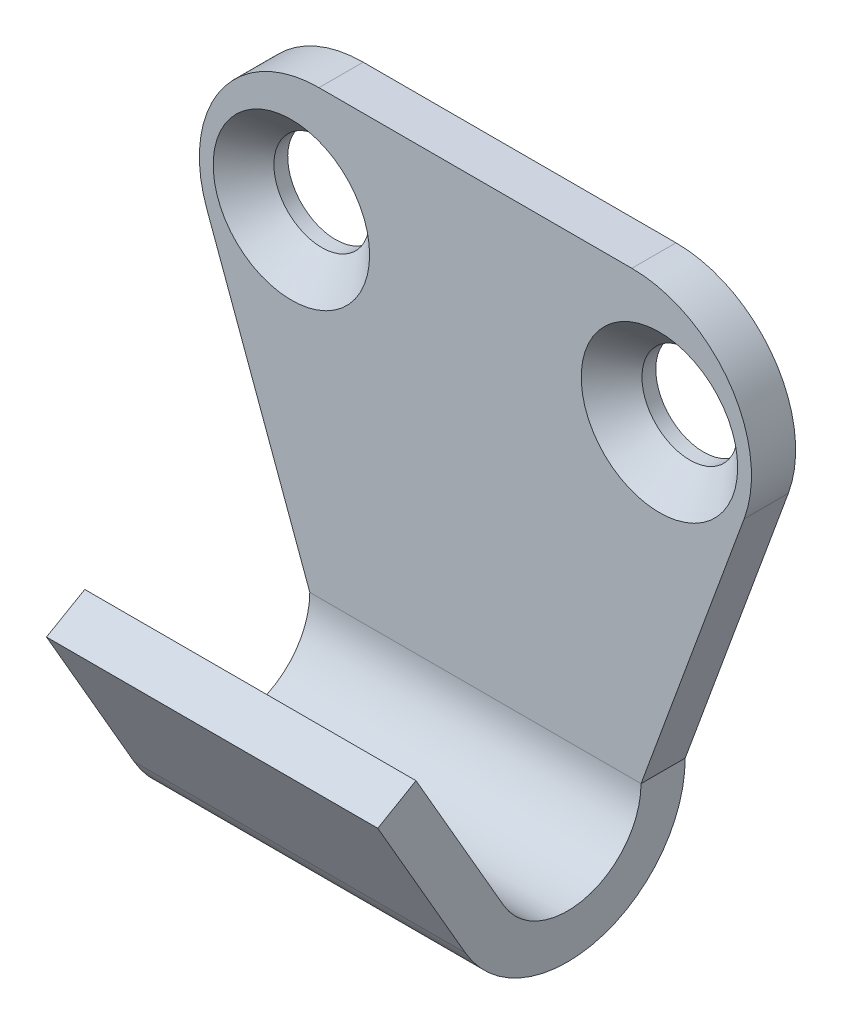
ISO-10303-21;
HEADER;
FILE_DESCRIPTION(('STEP AP214'),'2;1');
FILE_NAME('part.step','',(''),(''),'','','');
FILE_SCHEMA(('AUTOMOTIVE_DESIGN { 1 0 10303 214 1 1 1 1 }'));
ENDSEC;
DATA;
#1=APPLICATION_CONTEXT('core data for automotive mechanical design processes');
#2=APPLICATION_PROTOCOL_DEFINITION('international standard','automotive_design',2000,#1);
#3=PRODUCT_CONTEXT('',#1,'mechanical');
#4=PRODUCT('Part','Part','',(#3));
#5=PRODUCT_RELATED_PRODUCT_CATEGORY('part','',(#4));
#6=PRODUCT_DEFINITION_FORMATION('','',#4);
#7=PRODUCT_DEFINITION_CONTEXT('part definition',#1,'design');
#8=PRODUCT_DEFINITION('design','',#6,#7);
#9=PRODUCT_DEFINITION_SHAPE('','',#8);
#10=(LENGTH_UNIT() NAMED_UNIT(*) SI_UNIT(.MILLI.,.METRE.));
#11=(NAMED_UNIT(*) PLANE_ANGLE_UNIT() SI_UNIT($,.RADIAN.));
#12=(NAMED_UNIT(*) SI_UNIT($,.STERADIAN.) SOLID_ANGLE_UNIT());
#13=UNCERTAINTY_MEASURE_WITH_UNIT(LENGTH_MEASURE(1.E-05),#10,'distance_accuracy_value','');
#14=(GEOMETRIC_REPRESENTATION_CONTEXT(3) GLOBAL_UNCERTAINTY_ASSIGNED_CONTEXT((#13)) GLOBAL_UNIT_ASSIGNED_CONTEXT((#10,
#11,#12)) REPRESENTATION_CONTEXT('',''));
#15=CARTESIAN_POINT('',(0.,0.,0.));
#16=DIRECTION('',(0.,0.,1.));
#17=DIRECTION('',(1.,0.,0.));
#18=AXIS2_PLACEMENT_3D('',#15,#16,#17);
#19=CARTESIAN_POINT('',(-0.0998757230143876,36.5453689760703,3.0802936243158));
#20=DIRECTION('',(0.,0.5,-0.866025403784439));
#21=DIRECTION('',(0.,0.866025403784439,0.5));
#22=AXIS2_PLACEMENT_3D('',#19,#20,#21);
#23=PLANE('',#22);
#24=DIRECTION('',(1.,0.,0.));
#25=VECTOR('',#24,1.);
#26=CARTESIAN_POINT('',(8.90012427698563,56.5467803394834,14.6281138591548));
#27=LINE('',#26,#25);
#28=CARTESIAN_POINT('',(8.90012427698561,56.5467803394834,14.6281138591548));
#29=VERTEX_POINT('',#28);
#30=CARTESIAN_POINT('',(-9.09987572301438,56.5467803394834,14.6281138591548));
#31=VERTEX_POINT('',#30);
#32=EDGE_CURVE('E93',#29,#31,#27,.F.);
#33=ORIENTED_EDGE('',*,*,#32,.F.);
#34=DIRECTION('',(0.,0.866025403784438,0.500000000000002));
#35=VECTOR('',#34,1.);
#36=CARTESIAN_POINT('',(8.90012427698561,48.2952690849657,9.86410161513776));
#37=LINE('',#36,#35);
#38=CARTESIAN_POINT('',(8.90012427698561,48.2952690849657,9.86410161513776));
#39=VERTEX_POINT('',#38);
#40=EDGE_CURVE('E122',#39,#29,#37,.T.);
#41=ORIENTED_EDGE('',*,*,#40,.F.);
#42=DIRECTION('',(1.,0.,0.));
#43=VECTOR('',#42,1.);
#44=CARTESIAN_POINT('',(-0.0998757230143811,48.2952690849657,9.86410161513775));
#45=LINE('',#44,#43);
#46=CARTESIAN_POINT('',(-9.09987572301438,48.2952690849657,9.86410161513775));
#47=VERTEX_POINT('',#46);
#48=EDGE_CURVE('E84',#47,#39,#45,.T.);
#49=ORIENTED_EDGE('',*,*,#48,.F.);
#50=DIRECTION('',(0.,-0.866025403784438,-0.500000000000002));
#51=VECTOR('',#50,1.);
#52=CARTESIAN_POINT('',(-9.09987572301437,56.5467803394834,14.6281138591548));
#53=LINE('',#52,#51);
#54=EDGE_CURVE('E135',#31,#47,#53,.T.);
#55=ORIENTED_EDGE('',*,*,#54,.F.);
#56=EDGE_LOOP('',(#33,#41,#49,#55));
#57=FACE_BOUND('',#56,.T.);
#58=ADVANCED_FACE('F16',(#57),#23,.T.);
#59=CARTESIAN_POINT('',(8.90012427698563,55.3467803394834,16.7065748282374));
#60=DIRECTION('',(0.,0.866025403784439,0.5));
#61=DIRECTION('',(0.,-0.5,0.866025403784439));
#62=AXIS2_PLACEMENT_3D('',#59,#60,#61);
#63=PLANE('',#62);
#64=DIRECTION('',(1.,0.,0.));
#65=VECTOR('',#64,1.);
#66=CARTESIAN_POINT('',(-0.0998757230143878,55.3467803394834,16.7065748282374));
#67=LINE('',#66,#65);
#68=CARTESIAN_POINT('',(8.90012427698561,55.3467803394834,16.7065748282374));
#69=VERTEX_POINT('',#68);
#70=CARTESIAN_POINT('',(-9.09987572301437,55.3467803394834,16.7065748282374));
#71=VERTEX_POINT('',#70);
#72=EDGE_CURVE('E98',#69,#71,#67,.F.);
#73=ORIENTED_EDGE('',*,*,#72,.F.);
#74=DIRECTION('',(0.,-0.500000000000007,0.866025403784435));
#75=VECTOR('',#74,1.);
#76=CARTESIAN_POINT('',(8.90012427698561,56.5467803394834,14.6281138591548));
#77=LINE('',#76,#75);
#78=EDGE_CURVE('E102',#29,#69,#77,.T.);
#79=ORIENTED_EDGE('',*,*,#78,.F.);
#80=ORIENTED_EDGE('',*,*,#32,.T.);
#81=DIRECTION('',(0.,0.500000000000007,-0.866025403784434));
#82=VECTOR('',#81,1.);
#83=CARTESIAN_POINT('',(-9.09987572301437,55.3467803394834,16.7065748282374));
#84=LINE('',#83,#82);
#85=EDGE_CURVE('E105',#71,#31,#84,.T.);
#86=ORIENTED_EDGE('',*,*,#85,.F.);
#87=EDGE_LOOP('',(#73,#79,#80,#86));
#88=FACE_BOUND('',#87,.T.);
#89=ADVANCED_FACE('F100',(#88),#63,.T.);
#90=CARTESIAN_POINT('',(8.90012427698561,50.2952690849657,6.4));
#91=DIRECTION('',(-1.,0.,0.));
#92=DIRECTION('',(0.,0.,1.));
#93=AXIS2_PLACEMENT_3D('',#90,#91,#92);
#94=CYLINDRICAL_SURFACE('',#93,4.);
#95=DIRECTION('',(1.,0.,0.));
#96=VECTOR('',#95,1.);
#97=CARTESIAN_POINT('',(-0.0998757230143808,50.2952690849657,2.4));
#98=LINE('',#97,#96);
#99=CARTESIAN_POINT('',(-9.09987572301439,50.2952690849657,2.4));
#100=VERTEX_POINT('',#99);
#101=CARTESIAN_POINT('',(8.9001242769856,50.2952690849657,2.4));
#102=VERTEX_POINT('',#101);
#103=EDGE_CURVE('E124',#100,#102,#98,.T.);
#104=ORIENTED_EDGE('',*,*,#103,.F.);
#105=CARTESIAN_POINT('',(-9.09987572301439,50.2952690849657,6.4));
#106=DIRECTION('',(-1.,0.,0.));
#107=DIRECTION('',(0.,0.,1.));
#108=AXIS2_PLACEMENT_3D('',#105,#106,#107);
#109=CIRCLE('',#108,4.);
#110=EDGE_CURVE('E20',#47,#100,#109,.F.);
#111=ORIENTED_EDGE('',*,*,#110,.F.);
#112=ORIENTED_EDGE('',*,*,#48,.T.);
#113=CARTESIAN_POINT('',(8.90012427698561,50.2952690849657,6.4));
#114=DIRECTION('',(-1.,0.,0.));
#115=DIRECTION('',(0.,0.,1.));
#116=AXIS2_PLACEMENT_3D('',#113,#114,#115);
#117=CIRCLE('',#116,4.);
#118=EDGE_CURVE('E117',#102,#39,#117,.T.);
#119=ORIENTED_EDGE('',*,*,#118,.F.);
#120=EDGE_LOOP('',(#104,#111,#112,#119));
#121=FACE_BOUND('',#120,.T.);
#122=ADVANCED_FACE('F175',(#121),#94,.F.);
#123=CARTESIAN_POINT('',(-0.0998757230143878,35.3453689760703,5.15875459339845));
#124=DIRECTION('',(0.,-0.5,0.866025403784439));
#125=DIRECTION('',(0.,-0.866025403784439,-0.5));
#126=AXIS2_PLACEMENT_3D('',#123,#124,#125);
#127=PLANE('',#126);
#128=ORIENTED_EDGE('',*,*,#72,.T.);
#129=DIRECTION('',(0.,0.86602540378444,0.499999999999998));
#130=VECTOR('',#129,1.);
#131=CARTESIAN_POINT('',(-9.09987572301437,47.0952690849657,11.9425625842204));
#132=LINE('',#131,#130);
#133=CARTESIAN_POINT('',(-9.09987572301438,47.0952690849657,11.9425625842204));
#134=VERTEX_POINT('',#133);
#135=EDGE_CURVE('E108',#134,#71,#132,.T.);
#136=ORIENTED_EDGE('',*,*,#135,.F.);
#137=DIRECTION('',(-1.,0.,0.));
#138=VECTOR('',#137,1.);
#139=CARTESIAN_POINT('',(-9.09987572301437,47.0952690849657,11.9425625842204));
#140=LINE('',#139,#138);
#141=CARTESIAN_POINT('',(8.90012427698561,47.0952690849657,11.9425625842204));
#142=VERTEX_POINT('',#141);
#143=EDGE_CURVE('E114',#142,#134,#140,.T.);
#144=ORIENTED_EDGE('',*,*,#143,.F.);
#145=DIRECTION('',(0.,-0.86602540378444,-0.499999999999998));
#146=VECTOR('',#145,1.);
#147=CARTESIAN_POINT('',(8.90012427698561,55.3467803394834,16.7065748282374));
#148=LINE('',#147,#146);
#149=EDGE_CURVE('E111',#69,#142,#148,.T.);
#150=ORIENTED_EDGE('',*,*,#149,.F.);
#151=EDGE_LOOP('',(#128,#136,#144,#150));
#152=FACE_BOUND('',#151,.T.);
#153=ADVANCED_FACE('F112',(#152),#127,.T.);
#154=CARTESIAN_POINT('',(-9.09987572301437,55.3467803394834,16.7065748282374));
#155=DIRECTION('',(-1.,0.,0.));
#156=DIRECTION('',(0.,-1.,0.));
#157=AXIS2_PLACEMENT_3D('',#154,#155,#156);
#158=PLANE('',#157);
#159=DIRECTION('',(0.,0.,1.));
#160=VECTOR('',#159,1.);
#161=CARTESIAN_POINT('',(-9.09987572301439,50.2952690849657,0.));
#162=LINE('',#161,#160);
#163=CARTESIAN_POINT('',(-9.09987572301439,50.2952690849657,0.));
#164=VERTEX_POINT('',#163);
#165=EDGE_CURVE('E157',#164,#100,#162,.T.);
#166=ORIENTED_EDGE('',*,*,#165,.F.);
#167=CARTESIAN_POINT('',(-9.09987572301439,50.2952690849657,6.4));
#168=DIRECTION('',(-1.,0.,0.));
#169=DIRECTION('',(0.,-1.,0.));
#170=AXIS2_PLACEMENT_3D('',#167,#168,#169);
#171=CIRCLE('',#170,6.4);
#172=EDGE_CURVE('E161',#134,#164,#171,.F.);
#173=ORIENTED_EDGE('',*,*,#172,.F.);
#174=ORIENTED_EDGE('',*,*,#135,.T.);
#175=ORIENTED_EDGE('',*,*,#85,.T.);
#176=ORIENTED_EDGE('',*,*,#54,.T.);
#177=ORIENTED_EDGE('',*,*,#110,.T.);
#178=EDGE_LOOP('',(#166,#173,#174,#175,#176,#177));
#179=FACE_BOUND('',#178,.T.);
#180=ADVANCED_FACE('F242',(#179),#158,.T.);
#181=CARTESIAN_POINT('',(-0.0998757230143808,53.3909095546436,2.4));
#182=DIRECTION('',(0.,0.,1.));
#183=DIRECTION('',(1.,0.,0.));
#184=AXIS2_PLACEMENT_3D('',#181,#182,#183);
#185=PLANE('',#184);
#186=CARTESIAN_POINT('',(-10.0998757230144,67.7952690849657,2.40000000000001));
#187=DIRECTION('',(0.,0.,1.));
#188=DIRECTION('',(1.,0.,0.));
#189=AXIS2_PLACEMENT_3D('',#186,#187,#188);
#190=CIRCLE('',#189,4.25000000000001);
#191=CARTESIAN_POINT('',(-5.84987572301439,67.7952690849657,2.40000000000001));
#192=VERTEX_POINT('',#191);
#193=EDGE_CURVE('E164',#192,#192,#190,.T.);
#194=ORIENTED_EDGE('',*,*,#193,.F.);
#195=EDGE_LOOP('',(#194));
#196=FACE_BOUND('',#195,.T.);
#197=CARTESIAN_POINT('',(9.90012427698563,67.7952690849657,2.39999999999998));
#198=DIRECTION('',(0.,0.,1.));
#199=DIRECTION('',(1.,0.,0.));
#200=AXIS2_PLACEMENT_3D('',#197,#198,#199);
#201=CIRCLE('',#200,4.24999999999999);
#202=CARTESIAN_POINT('',(14.1501242769856,67.7952690849657,2.39999999999998));
#203=VERTEX_POINT('',#202);
#204=EDGE_CURVE('E167',#203,#203,#201,.T.);
#205=ORIENTED_EDGE('',*,*,#204,.F.);
#206=EDGE_LOOP('',(#205));
#207=FACE_BOUND('',#206,.T.);
#208=CARTESIAN_POINT('',(-8.59987572301437,67.7952690849657,2.4));
#209=DIRECTION('',(0.,0.,1.));
#210=DIRECTION('',(1.,0.,0.));
#211=AXIS2_PLACEMENT_3D('',#208,#209,#210);
#212=CIRCLE('',#211,6.5);
#213=CARTESIAN_POINT('',(-14.7017309711294,65.5553220920547,2.4));
#214=VERTEX_POINT('',#213);
#215=CARTESIAN_POINT('',(-8.59987572301437,74.2952690849657,2.4));
#216=VERTEX_POINT('',#215);
#217=EDGE_CURVE('E153',#214,#216,#212,.F.);
#218=ORIENTED_EDGE('',*,*,#217,.F.);
#219=DIRECTION('',(0.344607229678615,-0.938746961248467,0.));
#220=VECTOR('',#219,1.);
#221=CARTESIAN_POINT('',(-9.09987572301439,50.2952690849657,2.4));
#222=LINE('',#221,#220);
#223=EDGE_CURVE('E160',#100,#214,#222,.F.);
#224=ORIENTED_EDGE('',*,*,#223,.F.);
#225=ORIENTED_EDGE('',*,*,#103,.T.);
#226=DIRECTION('',(0.344607229678615,0.938746961248467,0.));
#227=VECTOR('',#226,1.);
#228=CARTESIAN_POINT('',(14.5019795251006,65.5553220920547,2.4));
#229=LINE('',#228,#227);
#230=CARTESIAN_POINT('',(14.5019795251006,65.5553220920547,2.4));
#231=VERTEX_POINT('',#230);
#232=EDGE_CURVE('E179',#231,#102,#229,.F.);
#233=ORIENTED_EDGE('',*,*,#232,.F.);
#234=CARTESIAN_POINT('',(8.40012427698563,67.7952690849657,2.4));
#235=DIRECTION('',(0.,0.,1.));
#236=DIRECTION('',(1.,0.,0.));
#237=AXIS2_PLACEMENT_3D('',#234,#235,#236);
#238=CIRCLE('',#237,6.5);
#239=CARTESIAN_POINT('',(8.40012427698563,74.2952690849657,2.4));
#240=VERTEX_POINT('',#239);
#241=EDGE_CURVE('E149',#240,#231,#238,.F.);
#242=ORIENTED_EDGE('',*,*,#241,.F.);
#243=DIRECTION('',(-1.,0.,0.));
#244=VECTOR('',#243,1.);
#245=CARTESIAN_POINT('',(-8.59987572301437,74.2952690849657,2.4));
#246=LINE('',#245,#244);
#247=EDGE_CURVE('E186',#216,#240,#246,.F.);
#248=ORIENTED_EDGE('',*,*,#247,.F.);
#249=EDGE_LOOP('',(#218,#224,#225,#233,#242,#248));
#250=FACE_BOUND('',#249,.T.);
#251=ADVANCED_FACE('F178',(#196,#207,#250),#185,.T.);
#252=CARTESIAN_POINT('',(8.90012427698561,38.0262722637946,6.70657482823742));
#253=DIRECTION('',(1.,0.,0.));
#254=DIRECTION('',(0.,1.,0.));
#255=AXIS2_PLACEMENT_3D('',#252,#253,#254);
#256=PLANE('',#255);
#257=DIRECTION('',(0.,0.,1.));
#258=VECTOR('',#257,1.);
#259=CARTESIAN_POINT('',(8.90012427698558,50.2952690849657,0.));
#260=LINE('',#259,#258);
#261=CARTESIAN_POINT('',(8.9001242769856,50.2952690849657,0.));
#262=VERTEX_POINT('',#261);
#263=EDGE_CURVE('E170',#102,#262,#260,.F.);
#264=ORIENTED_EDGE('',*,*,#263,.F.);
#265=ORIENTED_EDGE('',*,*,#118,.T.);
#266=ORIENTED_EDGE('',*,*,#40,.T.);
#267=ORIENTED_EDGE('',*,*,#78,.T.);
#268=ORIENTED_EDGE('',*,*,#149,.T.);
#269=CARTESIAN_POINT('',(8.90012427698561,50.2952690849657,6.4));
#270=DIRECTION('',(-1.,0.,0.));
#271=DIRECTION('',(0.,-1.,0.));
#272=AXIS2_PLACEMENT_3D('',#269,#270,#271);
#273=CIRCLE('',#272,6.4);
#274=EDGE_CURVE('E158',#262,#142,#273,.T.);
#275=ORIENTED_EDGE('',*,*,#274,.F.);
#276=EDGE_LOOP('',(#264,#265,#266,#267,#268,#275));
#277=FACE_BOUND('',#276,.T.);
#278=ADVANCED_FACE('F120',(#277),#256,.T.);
#279=CARTESIAN_POINT('',(9.90012427698563,67.7952690849657,0.749999999999991));
#280=DIRECTION('',(0.,0.,1.));
#281=DIRECTION('',(1.,0.,0.));
#282=AXIS2_PLACEMENT_3D('',#279,#280,#281);
#283=CONICAL_SURFACE('',#282,2.6,0.785398163397449);
#284=CARTESIAN_POINT('',(9.90012427698563,67.7952690849657,0.75));
#285=DIRECTION('',(0.,0.,1.));
#286=DIRECTION('',(1.,0.,0.));
#287=AXIS2_PLACEMENT_3D('',#284,#285,#286);
#288=CIRCLE('',#287,2.59999999999999);
#289=CARTESIAN_POINT('',(12.5001242769856,67.7952690849657,0.75));
#290=VERTEX_POINT('',#289);
#291=EDGE_CURVE('E221',#290,#290,#288,.T.);
#292=ORIENTED_EDGE('',*,*,#291,.F.);
#293=EDGE_LOOP('',(#292));
#294=FACE_BOUND('',#293,.T.);
#295=ORIENTED_EDGE('',*,*,#204,.T.);
#296=EDGE_LOOP('',(#295));
#297=FACE_BOUND('',#296,.T.);
#298=ADVANCED_FACE('F281',(#294,#297),#283,.F.);
#299=CARTESIAN_POINT('',(-10.0998757230144,67.7952690849657,0.74999999999999));
#300=DIRECTION('',(0.,0.,1.));
#301=DIRECTION('',(1.,0.,0.));
#302=AXIS2_PLACEMENT_3D('',#299,#300,#301);
#303=CONICAL_SURFACE('',#302,2.6,0.785398163397445);
#304=CARTESIAN_POINT('',(-10.0998757230144,67.7952690849657,0.75));
#305=DIRECTION('',(0.,0.,1.));
#306=DIRECTION('',(1.,0.,0.));
#307=AXIS2_PLACEMENT_3D('',#304,#305,#306);
#308=CIRCLE('',#307,2.59999999999999);
#309=CARTESIAN_POINT('',(-7.49987572301441,67.7952690849657,0.75));
#310=VERTEX_POINT('',#309);
#311=EDGE_CURVE('E208',#310,#310,#308,.T.);
#312=ORIENTED_EDGE('',*,*,#311,.F.);
#313=EDGE_LOOP('',(#312));
#314=FACE_BOUND('',#313,.T.);
#315=ORIENTED_EDGE('',*,*,#193,.T.);
#316=EDGE_LOOP('',(#315));
#317=FACE_BOUND('',#316,.T.);
#318=ADVANCED_FACE('F278',(#314,#317),#303,.F.);
#319=CARTESIAN_POINT('',(-9.09987572301437,50.2952690849657,6.4));
#320=DIRECTION('',(-1.,0.,0.));
#321=DIRECTION('',(0.,-1.,0.));
#322=AXIS2_PLACEMENT_3D('',#319,#320,#321);
#323=CYLINDRICAL_SURFACE('',#322,6.4);
#324=DIRECTION('',(-1.,0.,0.));
#325=VECTOR('',#324,1.);
#326=CARTESIAN_POINT('',(-0.0998757230143802,50.2952690849657,0.));
#327=LINE('',#326,#325);
#328=EDGE_CURVE('E204',#262,#164,#327,.T.);
#329=ORIENTED_EDGE('',*,*,#328,.F.);
#330=ORIENTED_EDGE('',*,*,#274,.T.);
#331=ORIENTED_EDGE('',*,*,#143,.T.);
#332=ORIENTED_EDGE('',*,*,#172,.T.);
#333=EDGE_LOOP('',(#329,#330,#331,#332));
#334=FACE_BOUND('',#333,.T.);
#335=ADVANCED_FACE('F200',(#334),#323,.T.);
#336=CARTESIAN_POINT('',(-9.09987572301439,50.2952690849657,0.));
#337=DIRECTION('',(-0.938746961248467,-0.344607229678615,0.));
#338=DIRECTION('',(0.344607229678615,-0.938746961248467,0.));
#339=AXIS2_PLACEMENT_3D('',#336,#337,#338);
#340=PLANE('',#339);
#341=DIRECTION('',(-0.344607229678614,0.938746961248467,0.));
#342=VECTOR('',#341,1.);
#343=CARTESIAN_POINT('',(-9.09987572301439,50.2952690849657,0.));
#344=LINE('',#343,#342);
#345=CARTESIAN_POINT('',(-14.7017309711294,65.5553220920547,0.));
#346=VERTEX_POINT('',#345);
#347=EDGE_CURVE('E148',#164,#346,#344,.T.);
#348=ORIENTED_EDGE('',*,*,#347,.F.);
#349=ORIENTED_EDGE('',*,*,#165,.T.);
#350=ORIENTED_EDGE('',*,*,#223,.T.);
#351=DIRECTION('',(0.,0.,1.));
#352=VECTOR('',#351,1.);
#353=CARTESIAN_POINT('',(-14.7017309711294,65.5553220920547,0.));
#354=LINE('',#353,#352);
#355=EDGE_CURVE('E156',#346,#214,#354,.T.);
#356=ORIENTED_EDGE('',*,*,#355,.F.);
#357=EDGE_LOOP('',(#348,#349,#350,#356));
#358=FACE_BOUND('',#357,.T.);
#359=ADVANCED_FACE('F240',(#358),#340,.T.);
#360=CARTESIAN_POINT('',(-8.59987572301437,67.7952690849657,0.));
#361=DIRECTION('',(0.,0.,1.));
#362=DIRECTION('',(1.,0.,0.));
#363=AXIS2_PLACEMENT_3D('',#360,#361,#362);
#364=CYLINDRICAL_SURFACE('',#363,6.5);
#365=CARTESIAN_POINT('',(-8.59987572301437,67.7952690849657,0.));
#366=DIRECTION('',(0.,0.,1.));
#367=DIRECTION('',(1.,0.,0.));
#368=AXIS2_PLACEMENT_3D('',#365,#366,#367);
#369=CIRCLE('',#368,6.5);
#370=CARTESIAN_POINT('',(-8.59987572301437,74.2952690849657,0.));
#371=VERTEX_POINT('',#370);
#372=EDGE_CURVE('E145',#346,#371,#369,.F.);
#373=ORIENTED_EDGE('',*,*,#372,.F.);
#374=ORIENTED_EDGE('',*,*,#355,.T.);
#375=ORIENTED_EDGE('',*,*,#217,.T.);
#376=DIRECTION('',(0.,0.,1.));
#377=VECTOR('',#376,1.);
#378=CARTESIAN_POINT('',(-8.59987572301437,74.2952690849657,0.));
#379=LINE('',#378,#377);
#380=EDGE_CURVE('E152',#371,#216,#379,.T.);
#381=ORIENTED_EDGE('',*,*,#380,.F.);
#382=EDGE_LOOP('',(#373,#374,#375,#381));
#383=FACE_BOUND('',#382,.T.);
#384=ADVANCED_FACE('F269',(#383),#364,.T.);
#385=CARTESIAN_POINT('',(-8.59987572301437,74.2952690849657,0.));
#386=DIRECTION('',(0.,1.,0.));
#387=DIRECTION('',(-1.,0.,0.));
#388=AXIS2_PLACEMENT_3D('',#385,#386,#387);
#389=PLANE('',#388);
#390=DIRECTION('',(-1.,0.,0.));
#391=VECTOR('',#390,1.);
#392=CARTESIAN_POINT('',(-0.0998757230143802,74.2952690849657,0.));
#393=LINE('',#392,#391);
#394=CARTESIAN_POINT('',(8.40012427698563,74.2952690849657,0.));
#395=VERTEX_POINT('',#394);
#396=EDGE_CURVE('E144',#371,#395,#393,.F.);
#397=ORIENTED_EDGE('',*,*,#396,.F.);
#398=ORIENTED_EDGE('',*,*,#380,.T.);
#399=ORIENTED_EDGE('',*,*,#247,.T.);
#400=DIRECTION('',(0.,0.,1.));
#401=VECTOR('',#400,1.);
#402=CARTESIAN_POINT('',(8.40012427698563,74.2952690849657,0.));
#403=LINE('',#402,#401);
#404=EDGE_CURVE('E151',#395,#240,#403,.T.);
#405=ORIENTED_EDGE('',*,*,#404,.F.);
#406=EDGE_LOOP('',(#397,#398,#399,#405));
#407=FACE_BOUND('',#406,.T.);
#408=ADVANCED_FACE('F266',(#407),#389,.T.);
#409=CARTESIAN_POINT('',(8.40012427698563,67.7952690849657,0.));
#410=DIRECTION('',(0.,0.,1.));
#411=DIRECTION('',(1.,0.,0.));
#412=AXIS2_PLACEMENT_3D('',#409,#410,#411);
#413=CYLINDRICAL_SURFACE('',#412,6.5);
#414=CARTESIAN_POINT('',(8.40012427698563,67.7952690849657,0.));
#415=DIRECTION('',(0.,0.,1.));
#416=DIRECTION('',(1.,0.,0.));
#417=AXIS2_PLACEMENT_3D('',#414,#415,#416);
#418=CIRCLE('',#417,6.5);
#419=CARTESIAN_POINT('',(14.5019795251006,65.5553220920547,0.));
#420=VERTEX_POINT('',#419);
#421=EDGE_CURVE('E141',#395,#420,#418,.F.);
#422=ORIENTED_EDGE('',*,*,#421,.F.);
#423=ORIENTED_EDGE('',*,*,#404,.T.);
#424=ORIENTED_EDGE('',*,*,#241,.T.);
#425=DIRECTION('',(0.,0.,1.));
#426=VECTOR('',#425,1.);
#427=CARTESIAN_POINT('',(14.5019795251006,65.5553220920547,0.));
#428=LINE('',#427,#426);
#429=EDGE_CURVE('E35',#420,#231,#428,.T.);
#430=ORIENTED_EDGE('',*,*,#429,.F.);
#431=EDGE_LOOP('',(#422,#423,#424,#430));
#432=FACE_BOUND('',#431,.T.);
#433=ADVANCED_FACE('F263',(#432),#413,.T.);
#434=CARTESIAN_POINT('',(14.5019795251006,65.5553220920547,0.));
#435=DIRECTION('',(0.938746961248467,-0.344607229678615,0.));
#436=DIRECTION('',(0.344607229678615,0.938746961248467,0.));
#437=AXIS2_PLACEMENT_3D('',#434,#435,#436);
#438=PLANE('',#437);
#439=DIRECTION('',(-0.344607229678613,-0.938746961248467,0.));
#440=VECTOR('',#439,1.);
#441=CARTESIAN_POINT('',(14.5019795251006,65.5553220920547,0.));
#442=LINE('',#441,#440);
#443=EDGE_CURVE('E140',#420,#262,#442,.T.);
#444=ORIENTED_EDGE('',*,*,#443,.F.);
#445=ORIENTED_EDGE('',*,*,#429,.T.);
#446=ORIENTED_EDGE('',*,*,#232,.T.);
#447=ORIENTED_EDGE('',*,*,#263,.T.);
#448=EDGE_LOOP('',(#444,#445,#446,#447));
#449=FACE_BOUND('',#448,.T.);
#450=ADVANCED_FACE('F211',(#449),#438,.T.);
#451=CARTESIAN_POINT('',(9.90012427698563,67.7952690849657,0.));
#452=DIRECTION('',(0.,0.,1.));
#453=DIRECTION('',(0.,-1.,0.));
#454=AXIS2_PLACEMENT_3D('',#451,#452,#453);
#455=CYLINDRICAL_SURFACE('',#454,2.59999999999999);
#456=CARTESIAN_POINT('',(9.90012427698563,67.7952690849657,0.));
#457=DIRECTION('',(0.,0.,1.));
#458=DIRECTION('',(0.,-1.,0.));
#459=AXIS2_PLACEMENT_3D('',#456,#457,#458);
#460=CIRCLE('',#459,2.59999999999999);
#461=CARTESIAN_POINT('',(9.90012427698563,65.1952690849657,0.));
#462=VERTEX_POINT('',#461);
#463=EDGE_CURVE('E26',#462,#462,#460,.T.);
#464=ORIENTED_EDGE('',*,*,#463,.F.);
#465=EDGE_LOOP('',(#464));
#466=FACE_BOUND('',#465,.T.);
#467=ORIENTED_EDGE('',*,*,#291,.T.);
#468=EDGE_LOOP('',(#467));
#469=FACE_BOUND('',#468,.T.);
#470=ADVANCED_FACE('F257',(#466,#469),#455,.F.);
#471=CARTESIAN_POINT('',(-10.0998757230144,67.7952690849657,0.));
#472=DIRECTION('',(0.,0.,1.));
#473=DIRECTION('',(0.,-1.,0.));
#474=AXIS2_PLACEMENT_3D('',#471,#472,#473);
#475=CYLINDRICAL_SURFACE('',#474,2.59999999999999);
#476=CARTESIAN_POINT('',(-10.0998757230144,67.7952690849657,0.));
#477=DIRECTION('',(0.,0.,1.));
#478=DIRECTION('',(0.,-1.,0.));
#479=AXIS2_PLACEMENT_3D('',#476,#477,#478);
#480=CIRCLE('',#479,2.59999999999999);
#481=CARTESIAN_POINT('',(-10.0998757230144,65.1952690849657,0.));
#482=VERTEX_POINT('',#481);
#483=EDGE_CURVE('E11',#482,#482,#480,.T.);
#484=ORIENTED_EDGE('',*,*,#483,.F.);
#485=EDGE_LOOP('',(#484));
#486=FACE_BOUND('',#485,.T.);
#487=ORIENTED_EDGE('',*,*,#311,.T.);
#488=EDGE_LOOP('',(#487));
#489=FACE_BOUND('',#488,.T.);
#490=ADVANCED_FACE('F18',(#486,#489),#475,.F.);
#491=CARTESIAN_POINT('',(-0.0998757230143802,53.3909095546436,0.));
#492=DIRECTION('',(0.,0.,-1.));
#493=DIRECTION('',(-1.,0.,0.));
#494=AXIS2_PLACEMENT_3D('',#491,#492,#493);
#495=PLANE('',#494);
#496=ORIENTED_EDGE('',*,*,#483,.T.);
#497=EDGE_LOOP('',(#496));
#498=FACE_BOUND('',#497,.T.);
#499=ORIENTED_EDGE('',*,*,#463,.T.);
#500=EDGE_LOOP('',(#499));
#501=FACE_BOUND('',#500,.T.);
#502=ORIENTED_EDGE('',*,*,#421,.T.);
#503=ORIENTED_EDGE('',*,*,#443,.T.);
#504=ORIENTED_EDGE('',*,*,#328,.T.);
#505=ORIENTED_EDGE('',*,*,#347,.T.);
#506=ORIENTED_EDGE('',*,*,#372,.T.);
#507=ORIENTED_EDGE('',*,*,#396,.T.);
#508=EDGE_LOOP('',(#502,#503,#504,#505,#506,#507));
#509=FACE_BOUND('',#508,.T.);
#510=ADVANCED_FACE('F213',(#498,#501,#509),#495,.T.);
#511=CLOSED_SHELL('',(#58,#89,#122,#153,#180,#251,#278,#298,#318,#335,#359,#384,#408,#433,#450,
#470,#490,#510));
#512=MANIFOLD_SOLID_BREP('B1',#511);
#513=ADVANCED_BREP_SHAPE_REPRESENTATION('',(#18,#512),#14);
#514=SHAPE_DEFINITION_REPRESENTATION(#9,#513);
ENDSEC;
END-ISO-10303-21;
